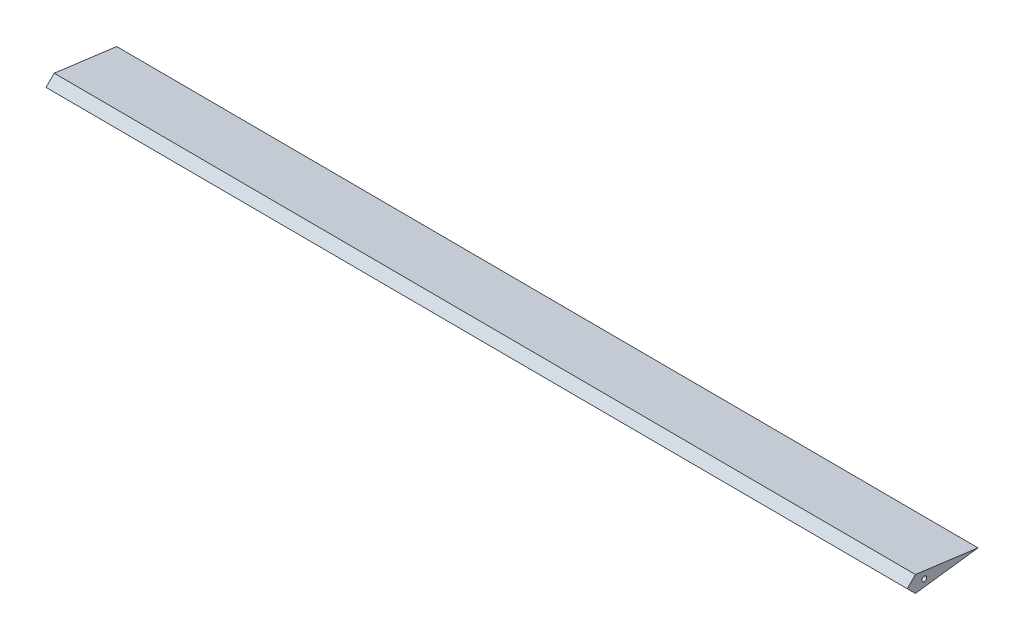
ISO-10303-21;
HEADER;
FILE_DESCRIPTION(('STEP AP214'),'2;1');
FILE_NAME('part.step','',(''),(''),'','','');
FILE_SCHEMA(('AUTOMOTIVE_DESIGN { 1 0 10303 214 1 1 1 1 }'));
ENDSEC;
DATA;
#1=APPLICATION_CONTEXT('core data for automotive mechanical design processes');
#2=APPLICATION_PROTOCOL_DEFINITION('international standard','automotive_design',2000,#1);
#3=PRODUCT_CONTEXT('',#1,'mechanical');
#4=PRODUCT('Part','Part','',(#3));
#5=PRODUCT_RELATED_PRODUCT_CATEGORY('part','',(#4));
#6=PRODUCT_DEFINITION_FORMATION('','',#4);
#7=PRODUCT_DEFINITION_CONTEXT('part definition',#1,'design');
#8=PRODUCT_DEFINITION('design','',#6,#7);
#9=PRODUCT_DEFINITION_SHAPE('','',#8);
#10=(LENGTH_UNIT() NAMED_UNIT(*) SI_UNIT(.MILLI.,.METRE.));
#11=(NAMED_UNIT(*) PLANE_ANGLE_UNIT() SI_UNIT($,.RADIAN.));
#12=(NAMED_UNIT(*) SI_UNIT($,.STERADIAN.) SOLID_ANGLE_UNIT());
#13=UNCERTAINTY_MEASURE_WITH_UNIT(LENGTH_MEASURE(1.E-05),#10,'distance_accuracy_value','');
#14=(GEOMETRIC_REPRESENTATION_CONTEXT(3) GLOBAL_UNCERTAINTY_ASSIGNED_CONTEXT((#13)) GLOBAL_UNIT_ASSIGNED_CONTEXT((#10,
#11,#12)) REPRESENTATION_CONTEXT('',''));
#15=CARTESIAN_POINT('',(0.,0.,0.));
#16=DIRECTION('',(0.,0.,1.));
#17=DIRECTION('',(1.,0.,0.));
#18=AXIS2_PLACEMENT_3D('',#15,#16,#17);
#19=CARTESIAN_POINT('',(482.691977653507,-10.4928743975499,81.9835626101573));
#20=DIRECTION('',(-0.000534412245564587,0.991507677347762,0.130047069032707));
#21=DIRECTION('',(0.,-0.130047087603201,0.991507818933328));
#22=AXIS2_PLACEMENT_3D('',#19,#20,#21);
#23=PLANE('',#22);
#24=DIRECTION('',(0.,0.130047087603201,-0.991507818933328));
#25=VECTOR('',#24,1.);
#26=CARTESIAN_POINT('',(482.691977653507,-10.4928743975499,81.9835626101573));
#27=LINE('',#26,#25);
#28=CARTESIAN_POINT('',(482.691977653507,-9.16023701057422,71.8232398121496));
#29=VERTEX_POINT('',#28);
#30=CARTESIAN_POINT('',(482.691977653507,0.,1.9835626101573));
#31=VERTEX_POINT('',#30);
#32=EDGE_CURVE('E58',#29,#31,#27,.T.);
#33=ORIENTED_EDGE('',*,*,#32,.F.);
#34=DIRECTION('',(-0.99999155662324,0.,-0.00410934085093643));
#35=VECTOR('',#34,1.);
#36=CARTESIAN_POINT('',(482.73372953051,-9.16023701057422,71.823411386292));
#37=LINE('',#36,#35);
#38=CARTESIAN_POINT('',(-482.691977653507,-9.16023701057421,67.856114591835));
#39=VERTEX_POINT('',#38);
#40=EDGE_CURVE('E77',#29,#39,#37,.T.);
#41=ORIENTED_EDGE('',*,*,#40,.T.);
#42=DIRECTION('',(0.,0.130047087603201,-0.991507818933328));
#43=VECTOR('',#42,1.);
#44=CARTESIAN_POINT('',(-482.691977653507,-10.4928743975499,78.0164373898427));
#45=LINE('',#44,#43);
#46=CARTESIAN_POINT('',(-482.691977653507,0.,-1.9835626101573));
#47=VERTEX_POINT('',#46);
#48=EDGE_CURVE('E91',#39,#47,#45,.T.);
#49=ORIENTED_EDGE('',*,*,#48,.T.);
#50=DIRECTION('',(-0.99999155662324,0.,-0.00410934085093643));
#51=VECTOR('',#50,1.);
#52=CARTESIAN_POINT('',(482.691977653507,0.,1.9835626101573));
#53=LINE('',#52,#51);
#54=EDGE_CURVE('E98',#31,#47,#53,.T.);
#55=ORIENTED_EDGE('',*,*,#54,.F.);
#56=EDGE_LOOP('',(#33,#41,#49,#55));
#57=FACE_BOUND('',#56,.T.);
#58=ADVANCED_FACE('F35',(#57),#23,.F.);
#59=CARTESIAN_POINT('',(482.691977653507,10.4928743975499,81.9835626101573));
#60=DIRECTION('',(-0.000534412245564587,-0.991507677347762,0.130047069032707));
#61=DIRECTION('',(0.,-0.130047087603201,-0.991507818933328));
#62=AXIS2_PLACEMENT_3D('',#59,#60,#61);
#63=PLANE('',#62);
#64=DIRECTION('',(0.,0.130047087603201,0.991507818933328));
#65=VECTOR('',#64,1.);
#66=CARTESIAN_POINT('',(-482.691977653507,10.4928743975499,78.0164373898427));
#67=LINE('',#66,#65);
#68=CARTESIAN_POINT('',(-482.691977653507,9.16023701057422,67.856114591835));
#69=VERTEX_POINT('',#68);
#70=EDGE_CURVE('E93',#47,#69,#67,.T.);
#71=ORIENTED_EDGE('',*,*,#70,.T.);
#72=DIRECTION('',(0.99999155662324,0.,0.00410934085093643));
#73=VECTOR('',#72,1.);
#74=CARTESIAN_POINT('',(482.73372953051,9.16023701057422,71.823411386292));
#75=LINE('',#74,#73);
#76=CARTESIAN_POINT('',(482.691977653507,9.16023701057422,71.8232398121496));
#77=VERTEX_POINT('',#76);
#78=EDGE_CURVE('E79',#69,#77,#75,.T.);
#79=ORIENTED_EDGE('',*,*,#78,.T.);
#80=DIRECTION('',(0.,0.130047087603201,0.991507818933328));
#81=VECTOR('',#80,1.);
#82=CARTESIAN_POINT('',(482.691977653507,10.4928743975499,81.9835626101573));
#83=LINE('',#82,#81);
#84=EDGE_CURVE('E90',#31,#77,#83,.T.);
#85=ORIENTED_EDGE('',*,*,#84,.F.);
#86=ORIENTED_EDGE('',*,*,#54,.T.);
#87=EDGE_LOOP('',(#71,#79,#85,#86));
#88=FACE_BOUND('',#87,.T.);
#89=ADVANCED_FACE('F120',(#88),#63,.F.);
#90=CARTESIAN_POINT('',(482.691977653507,0.,1.9835626101573));
#91=DIRECTION('',(1.,0.,0.));
#92=DIRECTION('',(0.,0.,-1.));
#93=AXIS2_PLACEMENT_3D('',#90,#91,#92);
#94=PLANE('',#93);
#95=DIRECTION('',(0.,0.707103795983158,-0.707109766377335));
#96=VECTOR('',#95,1.);
#97=CARTESIAN_POINT('',(482.691977653507,39.499995776868,41.4832248736784));
#98=LINE('',#97,#96);
#99=CARTESIAN_POINT('',(482.691977653507,0.,80.9835541667093));
#100=VERTEX_POINT('',#99);
#101=EDGE_CURVE('E83',#100,#77,#98,.T.);
#102=ORIENTED_EDGE('',*,*,#101,.F.);
#103=DIRECTION('',(0.,0.707103795983158,0.707109766377334));
#104=VECTOR('',#103,1.);
#105=CARTESIAN_POINT('',(482.691977653507,-39.499995776868,41.4832248736785));
#106=LINE('',#105,#104);
#107=EDGE_CURVE('E74',#29,#100,#106,.T.);
#108=ORIENTED_EDGE('',*,*,#107,.F.);
#109=ORIENTED_EDGE('',*,*,#32,.T.);
#110=ORIENTED_EDGE('',*,*,#84,.T.);
#111=EDGE_LOOP('',(#102,#108,#109,#110));
#112=FACE_BOUND('',#111,.T.);
#113=CARTESIAN_POINT('',(482.691977653507,0.,61.9840692170404));
#114=DIRECTION('',(1.,0.,0.));
#115=DIRECTION('',(0.,0.,-1.));
#116=AXIS2_PLACEMENT_3D('',#113,#114,#115);
#117=ELLIPSE('',#116,2.75002321948214,2.75);
#118=CARTESIAN_POINT('',(482.691977653507,0.,59.2340459975582));
#119=VERTEX_POINT('',#118);
#120=EDGE_CURVE('E105',#119,#119,#117,.T.);
#121=ORIENTED_EDGE('',*,*,#120,.F.);
#122=EDGE_LOOP('',(#121));
#123=FACE_BOUND('',#122,.T.);
#124=ADVANCED_FACE('F88',(#112,#123),#94,.T.);
#125=CARTESIAN_POINT('',(-482.691977653507,0.,-1.9835626101573));
#126=DIRECTION('',(1.,0.,0.));
#127=DIRECTION('',(0.,0.,-1.));
#128=AXIS2_PLACEMENT_3D('',#125,#126,#127);
#129=PLANE('',#128);
#130=CARTESIAN_POINT('',(-482.691977653507,0.,58.0169439967258));
#131=DIRECTION('',(1.,0.,0.));
#132=DIRECTION('',(0.,0.,-1.));
#133=AXIS2_PLACEMENT_3D('',#130,#131,#132);
#134=ELLIPSE('',#133,2.75002321948214,2.75);
#135=CARTESIAN_POINT('',(-482.691977653507,0.,55.2669207772436));
#136=VERTEX_POINT('',#135);
#137=EDGE_CURVE('E86',#136,#136,#134,.T.);
#138=ORIENTED_EDGE('',*,*,#137,.T.);
#139=EDGE_LOOP('',(#138));
#140=FACE_BOUND('',#139,.T.);
#141=DIRECTION('',(0.,0.707103795983158,0.707109766377334));
#142=VECTOR('',#141,1.);
#143=CARTESIAN_POINT('',(-482.691977653507,-39.499995776868,37.5160996533639));
#144=LINE('',#143,#142);
#145=CARTESIAN_POINT('',(-482.691977653507,0.,77.0164289463947));
#146=VERTEX_POINT('',#145);
#147=EDGE_CURVE('E42',#39,#146,#144,.T.);
#148=ORIENTED_EDGE('',*,*,#147,.T.);
#149=DIRECTION('',(0.,0.707103795983158,-0.707109766377335));
#150=VECTOR('',#149,1.);
#151=CARTESIAN_POINT('',(-482.691977653507,39.499995776868,37.5160996533639));
#152=LINE('',#151,#150);
#153=EDGE_CURVE('E11',#146,#69,#152,.T.);
#154=ORIENTED_EDGE('',*,*,#153,.T.);
#155=ORIENTED_EDGE('',*,*,#70,.F.);
#156=ORIENTED_EDGE('',*,*,#48,.F.);
#157=EDGE_LOOP('',(#148,#154,#155,#156));
#158=FACE_BOUND('',#157,.T.);
#159=ADVANCED_FACE('F108',(#140,#158),#129,.F.);
#160=CARTESIAN_POINT('',(482.774161694789,0.,61.98440694213));
#161=DIRECTION('',(-0.99999155662324,0.,-0.00410934085093643));
#162=DIRECTION('',(-0.00410934085093643,0.,0.99999155662324));
#163=AXIS2_PLACEMENT_3D('',#160,#161,#162);
#164=CYLINDRICAL_SURFACE('',#163,2.75);
#165=ORIENTED_EDGE('',*,*,#120,.T.);
#166=EDGE_LOOP('',(#165));
#167=FACE_BOUND('',#166,.T.);
#168=ORIENTED_EDGE('',*,*,#137,.F.);
#169=EDGE_LOOP('',(#168));
#170=FACE_BOUND('',#169,.T.);
#171=ADVANCED_FACE('F117',(#167,#170),#164,.F.);
#172=CARTESIAN_POINT('',(482.739205791764,10.4928743975499,70.4907852512758));
#173=DIRECTION('',(0.00290574278190403,-0.707106781186552,-0.70710081081758));
#174=DIRECTION('',(0.,0.707103795983158,-0.707109766377335));
#175=AXIS2_PLACEMENT_3D('',#172,#173,#174);
#176=PLANE('',#175);
#177=ORIENTED_EDGE('',*,*,#101,.T.);
#178=ORIENTED_EDGE('',*,*,#78,.F.);
#179=ORIENTED_EDGE('',*,*,#153,.F.);
#180=DIRECTION('',(-0.99999155662324,0.,-0.00410934085093643));
#181=VECTOR('',#180,1.);
#182=CARTESIAN_POINT('',(482.696086994358,0.,80.9835710535341));
#183=LINE('',#182,#181);
#184=EDGE_CURVE('E49',#100,#146,#183,.T.);
#185=ORIENTED_EDGE('',*,*,#184,.F.);
#186=EDGE_LOOP('',(#177,#178,#179,#185));
#187=FACE_BOUND('',#186,.T.);
#188=ADVANCED_FACE('F82',(#187),#176,.F.);
#189=CARTESIAN_POINT('',(482.696086994358,0.,80.9835710535341));
#190=DIRECTION('',(0.00290574278190403,0.707106781186551,-0.707100810817581));
#191=DIRECTION('',(0.,0.707103795983158,0.707109766377334));
#192=AXIS2_PLACEMENT_3D('',#189,#190,#191);
#193=PLANE('',#192);
#194=ORIENTED_EDGE('',*,*,#107,.T.);
#195=ORIENTED_EDGE('',*,*,#184,.T.);
#196=ORIENTED_EDGE('',*,*,#147,.F.);
#197=ORIENTED_EDGE('',*,*,#40,.F.);
#198=EDGE_LOOP('',(#194,#195,#196,#197));
#199=FACE_BOUND('',#198,.T.);
#200=ADVANCED_FACE('F75',(#199),#193,.F.);
#201=CLOSED_SHELL('',(#58,#89,#124,#159,#171,#188,#200));
#202=MANIFOLD_SOLID_BREP('B2',#201);
#203=ADVANCED_BREP_SHAPE_REPRESENTATION('',(#18,#202),#14);
#204=SHAPE_DEFINITION_REPRESENTATION(#9,#203);
ENDSEC;
END-ISO-10303-21;
